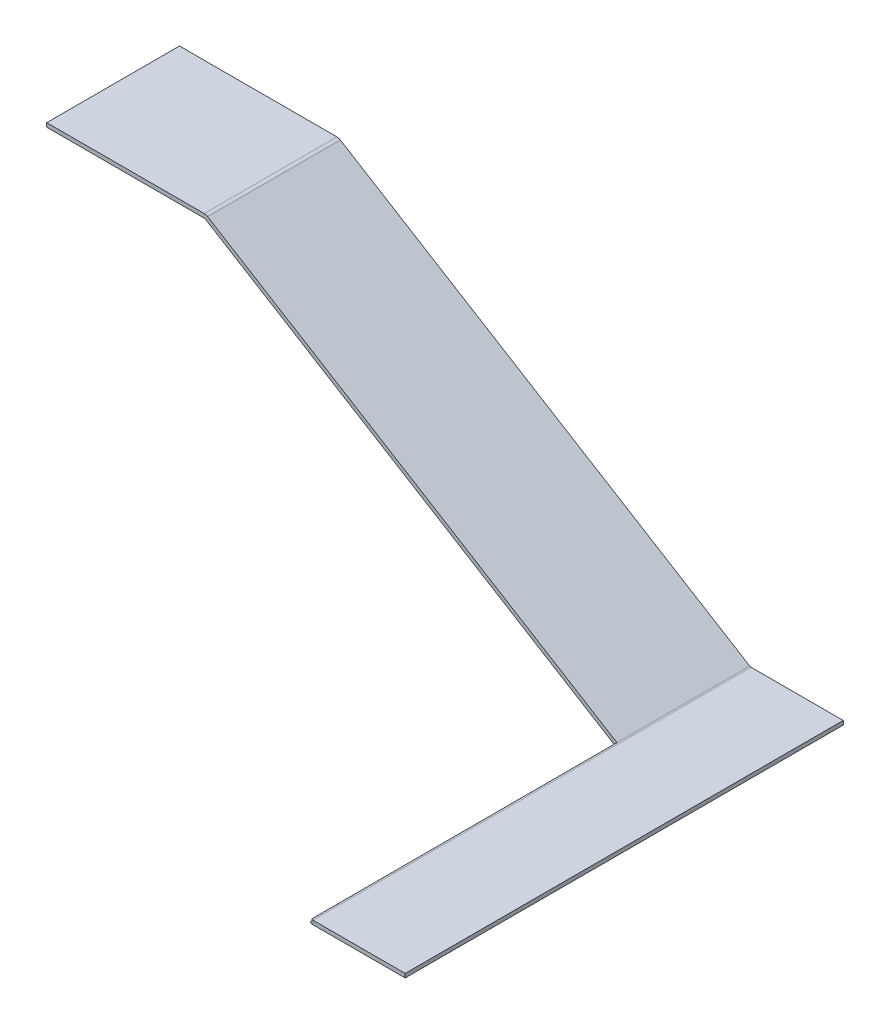
ISO-10303-21;
HEADER;
FILE_DESCRIPTION(('STEP AP214'),'2;1');
FILE_NAME('part.step','',(''),(''),'','','');
FILE_SCHEMA(('AUTOMOTIVE_DESIGN { 1 0 10303 214 1 1 1 1 }'));
ENDSEC;
DATA;
#1=APPLICATION_CONTEXT('core data for automotive mechanical design processes');
#2=APPLICATION_PROTOCOL_DEFINITION('international standard','automotive_design',2000,#1);
#3=PRODUCT_CONTEXT('',#1,'mechanical');
#4=PRODUCT('Part','Part','',(#3));
#5=PRODUCT_RELATED_PRODUCT_CATEGORY('part','',(#4));
#6=PRODUCT_DEFINITION_FORMATION('','',#4);
#7=PRODUCT_DEFINITION_CONTEXT('part definition',#1,'design');
#8=PRODUCT_DEFINITION('design','',#6,#7);
#9=PRODUCT_DEFINITION_SHAPE('','',#8);
#10=(LENGTH_UNIT() NAMED_UNIT(*) SI_UNIT(.MILLI.,.METRE.));
#11=(NAMED_UNIT(*) PLANE_ANGLE_UNIT() SI_UNIT($,.RADIAN.));
#12=(NAMED_UNIT(*) SI_UNIT($,.STERADIAN.) SOLID_ANGLE_UNIT());
#13=UNCERTAINTY_MEASURE_WITH_UNIT(LENGTH_MEASURE(1.E-05),#10,'distance_accuracy_value','');
#14=(GEOMETRIC_REPRESENTATION_CONTEXT(3) GLOBAL_UNCERTAINTY_ASSIGNED_CONTEXT((#13)) GLOBAL_UNIT_ASSIGNED_CONTEXT((#10,
#11,#12)) REPRESENTATION_CONTEXT('',''));
#15=CARTESIAN_POINT('',(0.,0.,0.));
#16=DIRECTION('',(0.,0.,1.));
#17=DIRECTION('',(1.,0.,0.));
#18=AXIS2_PLACEMENT_3D('',#15,#16,#17);
#19=CARTESIAN_POINT('',(59.2948265887637,0.,0.));
#20=DIRECTION('',(0.,0.,-1.));
#21=DIRECTION('',(-1.,0.,0.));
#22=AXIS2_PLACEMENT_3D('',#19,#20,#21);
#23=PLANE('',#22);
#24=DIRECTION('',(0.,-1.,0.));
#25=VECTOR('',#24,1.);
#26=CARTESIAN_POINT('',(59.2948265887637,0.,0.));
#27=LINE('',#26,#25);
#28=CARTESIAN_POINT('',(59.2948265887637,0.,0.));
#29=VERTEX_POINT('',#28);
#30=CARTESIAN_POINT('',(59.2948265887637,-1.5,0.));
#31=VERTEX_POINT('',#30);
#32=EDGE_CURVE('E267',#29,#31,#27,.T.);
#33=ORIENTED_EDGE('',*,*,#32,.F.);
#34=CARTESIAN_POINT('',(59.2948265887637,-2.5,0.));
#35=DIRECTION('',(0.,0.,1.));
#36=DIRECTION('',(1.,0.,0.));
#37=AXIS2_PLACEMENT_3D('',#34,#35,#36);
#38=CIRCLE('',#37,2.5);
#39=CARTESIAN_POINT('',(60.6012317335869,-0.368496868972642,0.));
#40=VERTEX_POINT('',#39);
#41=EDGE_CURVE('E214',#29,#40,#38,.F.);
#42=ORIENTED_EDGE('',*,*,#41,.T.);
#43=DIRECTION('',(0.522562057929286,0.852601252410943,0.));
#44=VECTOR('',#43,1.);
#45=CARTESIAN_POINT('',(59.817388646693,-1.64739874758906,0.));
#46=LINE('',#45,#44);
#47=CARTESIAN_POINT('',(59.817388646693,-1.64739874758906,0.));
#48=VERTEX_POINT('',#47);
#49=EDGE_CURVE('E264',#48,#40,#46,.T.);
#50=ORIENTED_EDGE('',*,*,#49,.F.);
#51=CARTESIAN_POINT('',(59.2948265887637,-2.5,0.));
#52=DIRECTION('',(0.,0.,1.));
#53=DIRECTION('',(1.,0.,0.));
#54=AXIS2_PLACEMENT_3D('',#51,#52,#53);
#55=CIRCLE('',#54,1.);
#56=EDGE_CURVE('E226',#31,#48,#55,.F.);
#57=ORIENTED_EDGE('',*,*,#56,.F.);
#58=EDGE_LOOP('',(#33,#42,#50,#57));
#59=FACE_BOUND('',#58,.T.);
#60=ADVANCED_FACE('F37',(#59),#23,.T.);
#61=CARTESIAN_POINT('',(59.817388646693,-1.64739874758906,0.));
#62=DIRECTION('',(0.,0.,-1.));
#63=DIRECTION('',(-1.,0.,0.));
#64=AXIS2_PLACEMENT_3D('',#61,#62,#63);
#65=PLANE('',#64);
#66=DIRECTION('',(1.,0.,0.));
#67=VECTOR('',#66,1.);
#68=CARTESIAN_POINT('',(0.,0.,0.));
#69=LINE('',#68,#67);
#70=CARTESIAN_POINT('',(0.,0.,0.));
#71=VERTEX_POINT('',#70);
#72=EDGE_CURVE('E217',#71,#29,#69,.T.);
#73=ORIENTED_EDGE('',*,*,#72,.T.);
#74=ORIENTED_EDGE('',*,*,#32,.T.);
#75=DIRECTION('',(1.,0.,0.));
#76=VECTOR('',#75,1.);
#77=CARTESIAN_POINT('',(0.,-1.5,0.));
#78=LINE('',#77,#76);
#79=CARTESIAN_POINT('',(0.,-1.5,0.));
#80=VERTEX_POINT('',#79);
#81=EDGE_CURVE('E223',#80,#31,#78,.T.);
#82=ORIENTED_EDGE('',*,*,#81,.F.);
#83=DIRECTION('',(0.,1.,0.));
#84=VECTOR('',#83,1.);
#85=CARTESIAN_POINT('',(0.,-1.5,0.));
#86=LINE('',#85,#84);
#87=EDGE_CURVE('E220',#80,#71,#86,.T.);
#88=ORIENTED_EDGE('',*,*,#87,.T.);
#89=EDGE_LOOP('',(#73,#74,#82,#88));
#90=FACE_BOUND('',#89,.T.);
#91=ADVANCED_FACE('F302',(#90),#65,.T.);
#92=CARTESIAN_POINT('',(215.282069364494,-95.,165.));
#93=DIRECTION('',(0.,0.,1.));
#94=DIRECTION('',(1.,0.,0.));
#95=AXIS2_PLACEMENT_3D('',#92,#93,#94);
#96=PLANE('',#95);
#97=DIRECTION('',(0.522562057929288,0.852601252410943,0.));
#98=VECTOR('',#97,1.);
#99=CARTESIAN_POINT('',(215.072665575553,-94.871655742262,165.));
#100=LINE('',#99,#98);
#101=CARTESIAN_POINT('',(214.219838846333,-96.2631098794108,165.));
#102=VERTEX_POINT('',#101);
#103=CARTESIAN_POINT('',(214.995640582677,-94.9973280990602,165.));
#104=VERTEX_POINT('',#103);
#105=EDGE_CURVE('E155',#102,#104,#100,.T.);
#106=ORIENTED_EDGE('',*,*,#105,.F.);
#107=CARTESIAN_POINT('',(215.282069364494,-94.,165.));
#108=DIRECTION('',(0.,0.,1.));
#109=DIRECTION('',(1.,0.,0.));
#110=AXIS2_PLACEMENT_3D('',#107,#108,#109);
#111=CIRCLE('',#110,2.5);
#112=CARTESIAN_POINT('',(215.282069364494,-96.5,165.));
#113=VERTEX_POINT('',#112);
#114=EDGE_CURVE('E60',#102,#113,#111,.T.);
#115=ORIENTED_EDGE('',*,*,#114,.T.);
#116=DIRECTION('',(0.,-1.,0.));
#117=VECTOR('',#116,1.);
#118=CARTESIAN_POINT('',(215.282069364494,-95.,165.));
#119=LINE('',#118,#117);
#120=CARTESIAN_POINT('',(215.282069364494,-95.,165.));
#121=VERTEX_POINT('',#120);
#122=EDGE_CURVE('E262',#121,#113,#119,.T.);
#123=ORIENTED_EDGE('',*,*,#122,.F.);
#124=CARTESIAN_POINT('',(215.282069364494,-94.,165.));
#125=DIRECTION('',(0.,0.,-1.));
#126=DIRECTION('',(-1.,0.,0.));
#127=AXIS2_PLACEMENT_3D('',#124,#125,#126);
#128=CIRCLE('',#127,1.);
#129=CARTESIAN_POINT('',(214.759507306565,-94.8526012524109,165.));
#130=VERTEX_POINT('',#129);
#131=EDGE_CURVE('E196',#130,#121,#128,.F.);
#132=ORIENTED_EDGE('',*,*,#131,.F.);
#133=DIRECTION('',(0.852601252410943,-0.522562057929288,0.));
#134=VECTOR('',#133,1.);
#135=CARTESIAN_POINT('',(215.205044371618,-95.1256723567982,165.));
#136=LINE('',#135,#134);
#137=EDGE_CURVE('E185',#130,#104,#136,.T.);
#138=ORIENTED_EDGE('',*,*,#137,.T.);
#139=EDGE_LOOP('',(#106,#115,#123,#132,#138));
#140=FACE_BOUND('',#139,.T.);
#141=ADVANCED_FACE('F273',(#140),#96,.T.);
#142=CARTESIAN_POINT('',(213.975664219671,-96.1315031310273,165.));
#143=DIRECTION('',(0.,0.,1.));
#144=DIRECTION('',(1.,0.,0.));
#145=AXIS2_PLACEMENT_3D('',#142,#143,#144);
#146=PLANE('',#145);
#147=DIRECTION('',(1.,0.,0.));
#148=VECTOR('',#147,1.);
#149=CARTESIAN_POINT('',(215.,-95.,165.));
#150=LINE('',#149,#148);
#151=CARTESIAN_POINT('',(250.,-95.,165.));
#152=VERTEX_POINT('',#151);
#153=EDGE_CURVE('E193',#121,#152,#150,.T.);
#154=ORIENTED_EDGE('',*,*,#153,.F.);
#155=ORIENTED_EDGE('',*,*,#122,.T.);
#156=DIRECTION('',(1.,0.,0.));
#157=VECTOR('',#156,1.);
#158=CARTESIAN_POINT('',(215.,-96.5,165.));
#159=LINE('',#158,#157);
#160=CARTESIAN_POINT('',(250.,-96.5,165.));
#161=VERTEX_POINT('',#160);
#162=EDGE_CURVE('E112',#113,#161,#159,.T.);
#163=ORIENTED_EDGE('',*,*,#162,.T.);
#164=DIRECTION('',(0.,-1.,0.));
#165=VECTOR('',#164,1.);
#166=CARTESIAN_POINT('',(250.,-95.,165.));
#167=LINE('',#166,#165);
#168=EDGE_CURVE('E189',#152,#161,#167,.T.);
#169=ORIENTED_EDGE('',*,*,#168,.F.);
#170=EDGE_LOOP('',(#154,#155,#163,#169));
#171=FACE_BOUND('',#170,.T.);
#172=ADVANCED_FACE('F333',(#171),#146,.T.);
#173=CARTESIAN_POINT('',(214.759507306565,-94.8526012524109,0.));
#174=DIRECTION('',(0.,0.,-1.));
#175=DIRECTION('',(-1.,0.,0.));
#176=AXIS2_PLACEMENT_3D('',#173,#174,#175);
#177=PLANE('',#176);
#178=DIRECTION('',(-0.522562057929298,-0.852601252410936,0.));
#179=VECTOR('',#178,1.);
#180=CARTESIAN_POINT('',(214.759507306565,-94.8526012524109,0.));
#181=LINE('',#180,#179);
#182=CARTESIAN_POINT('',(214.759507306565,-94.8526012524109,0.));
#183=VERTEX_POINT('',#182);
#184=CARTESIAN_POINT('',(213.975664219671,-96.1315031310273,0.));
#185=VERTEX_POINT('',#184);
#186=EDGE_CURVE('E259',#183,#185,#181,.T.);
#187=ORIENTED_EDGE('',*,*,#186,.F.);
#188=CARTESIAN_POINT('',(215.282069364494,-94.,0.));
#189=DIRECTION('',(0.,0.,-1.));
#190=DIRECTION('',(-1.,0.,0.));
#191=AXIS2_PLACEMENT_3D('',#188,#189,#190);
#192=CIRCLE('',#191,1.);
#193=CARTESIAN_POINT('',(215.282069364494,-95.,0.));
#194=VERTEX_POINT('',#193);
#195=EDGE_CURVE('E209',#183,#194,#192,.F.);
#196=ORIENTED_EDGE('',*,*,#195,.T.);
#197=DIRECTION('',(0.,1.,0.));
#198=VECTOR('',#197,1.);
#199=CARTESIAN_POINT('',(215.282069364494,-96.5,0.));
#200=LINE('',#199,#198);
#201=CARTESIAN_POINT('',(215.282069364494,-96.5,0.));
#202=VERTEX_POINT('',#201);
#203=EDGE_CURVE('E105',#202,#194,#200,.T.);
#204=ORIENTED_EDGE('',*,*,#203,.F.);
#205=CARTESIAN_POINT('',(215.282069364494,-94.,0.));
#206=DIRECTION('',(0.,0.,1.));
#207=DIRECTION('',(1.,0.,0.));
#208=AXIS2_PLACEMENT_3D('',#205,#206,#207);
#209=CIRCLE('',#208,2.5);
#210=EDGE_CURVE('E190',#185,#202,#209,.T.);
#211=ORIENTED_EDGE('',*,*,#210,.F.);
#212=EDGE_LOOP('',(#187,#196,#204,#211));
#213=FACE_BOUND('',#212,.T.);
#214=ADVANCED_FACE('F284',(#213),#177,.T.);
#215=CARTESIAN_POINT('',(215.282069364494,-96.5,0.));
#216=DIRECTION('',(0.,0.,-1.));
#217=DIRECTION('',(-1.,0.,0.));
#218=AXIS2_PLACEMENT_3D('',#215,#216,#217);
#219=PLANE('',#218);
#220=DIRECTION('',(0.852601252410943,-0.522562057929287,0.));
#221=VECTOR('',#220,1.);
#222=CARTESIAN_POINT('',(60.,0.,0.));
#223=LINE('',#222,#221);
#224=EDGE_CURVE('E211',#40,#183,#223,.T.);
#225=ORIENTED_EDGE('',*,*,#224,.T.);
#226=ORIENTED_EDGE('',*,*,#186,.T.);
#227=DIRECTION('',(0.852601252410943,-0.522562057929288,0.));
#228=VECTOR('',#227,1.);
#229=CARTESIAN_POINT('',(59.2161569131061,-1.27890187861641,0.));
#230=LINE('',#229,#228);
#231=EDGE_CURVE('E229',#48,#185,#230,.T.);
#232=ORIENTED_EDGE('',*,*,#231,.F.);
#233=ORIENTED_EDGE('',*,*,#49,.T.);
#234=EDGE_LOOP('',(#225,#226,#232,#233));
#235=FACE_BOUND('',#234,.T.);
#236=ADVANCED_FACE('F287',(#235),#219,.T.);
#237=CARTESIAN_POINT('',(215.,-96.5,165.));
#238=DIRECTION('',(0.,1.,0.));
#239=DIRECTION('',(0.,0.,1.));
#240=AXIS2_PLACEMENT_3D('',#237,#238,#239);
#241=PLANE('',#240);
#242=DIRECTION('',(1.,0.,0.));
#243=VECTOR('',#242,1.);
#244=CARTESIAN_POINT('',(215.,-96.5,0.));
#245=LINE('',#244,#243);
#246=CARTESIAN_POINT('',(250.,-96.5,0.));
#247=VERTEX_POINT('',#246);
#248=EDGE_CURVE('E187',#202,#247,#245,.T.);
#249=ORIENTED_EDGE('',*,*,#248,.T.);
#250=DIRECTION('',(0.,0.,-1.));
#251=VECTOR('',#250,1.);
#252=CARTESIAN_POINT('',(250.,-96.5,165.));
#253=LINE('',#252,#251);
#254=EDGE_CURVE('E256',#161,#247,#253,.T.);
#255=ORIENTED_EDGE('',*,*,#254,.F.);
#256=ORIENTED_EDGE('',*,*,#162,.F.);
#257=DIRECTION('',(0.,0.,-1.));
#258=VECTOR('',#257,1.);
#259=CARTESIAN_POINT('',(215.282069364494,-96.5,165.));
#260=LINE('',#259,#258);
#261=EDGE_CURVE('E200',#113,#202,#260,.T.);
#262=ORIENTED_EDGE('',*,*,#261,.T.);
#263=EDGE_LOOP('',(#249,#255,#256,#262));
#264=FACE_BOUND('',#263,.T.);
#265=ADVANCED_FACE('F342',(#264),#241,.F.);
#266=CARTESIAN_POINT('',(250.,-95.,165.));
#267=DIRECTION('',(1.,0.,0.));
#268=DIRECTION('',(0.,0.,-1.));
#269=AXIS2_PLACEMENT_3D('',#266,#267,#268);
#270=PLANE('',#269);
#271=DIRECTION('',(0.,-1.,0.));
#272=VECTOR('',#271,1.);
#273=CARTESIAN_POINT('',(250.,-95.,0.));
#274=LINE('',#273,#272);
#275=CARTESIAN_POINT('',(250.,-95.,0.));
#276=VERTEX_POINT('',#275);
#277=EDGE_CURVE('E203',#276,#247,#274,.T.);
#278=ORIENTED_EDGE('',*,*,#277,.F.);
#279=DIRECTION('',(0.,0.,-1.));
#280=VECTOR('',#279,1.);
#281=CARTESIAN_POINT('',(250.,-95.,165.));
#282=LINE('',#281,#280);
#283=EDGE_CURVE('E254',#152,#276,#282,.T.);
#284=ORIENTED_EDGE('',*,*,#283,.F.);
#285=ORIENTED_EDGE('',*,*,#168,.T.);
#286=ORIENTED_EDGE('',*,*,#254,.T.);
#287=EDGE_LOOP('',(#278,#284,#285,#286));
#288=FACE_BOUND('',#287,.T.);
#289=ADVANCED_FACE('F345',(#288),#270,.T.);
#290=CARTESIAN_POINT('',(215.,-95.,165.));
#291=DIRECTION('',(0.,1.,0.));
#292=DIRECTION('',(0.,0.,1.));
#293=AXIS2_PLACEMENT_3D('',#290,#291,#292);
#294=PLANE('',#293);
#295=DIRECTION('',(1.,0.,0.));
#296=VECTOR('',#295,1.);
#297=CARTESIAN_POINT('',(215.,-95.,0.));
#298=LINE('',#297,#296);
#299=EDGE_CURVE('E206',#194,#276,#298,.T.);
#300=ORIENTED_EDGE('',*,*,#299,.F.);
#301=DIRECTION('',(0.,0.,-1.));
#302=VECTOR('',#301,1.);
#303=CARTESIAN_POINT('',(215.282069364494,-95.,165.));
#304=LINE('',#303,#302);
#305=EDGE_CURVE('E251',#121,#194,#304,.T.);
#306=ORIENTED_EDGE('',*,*,#305,.F.);
#307=ORIENTED_EDGE('',*,*,#153,.T.);
#308=ORIENTED_EDGE('',*,*,#283,.T.);
#309=EDGE_LOOP('',(#300,#306,#307,#308));
#310=FACE_BOUND('',#309,.T.);
#311=ADVANCED_FACE('F349',(#310),#294,.T.);
#312=CARTESIAN_POINT('',(215.282069364494,-94.,165.));
#313=DIRECTION('',(0.,0.,-1.));
#314=DIRECTION('',(-1.,0.,0.));
#315=AXIS2_PLACEMENT_3D('',#312,#313,#314);
#316=CYLINDRICAL_SURFACE('',#315,1.);
#317=ORIENTED_EDGE('',*,*,#195,.F.);
#318=DIRECTION('',(0.,0.,-1.));
#319=VECTOR('',#318,1.);
#320=CARTESIAN_POINT('',(214.759507306565,-94.8526012524109,165.));
#321=LINE('',#320,#319);
#322=CARTESIAN_POINT('',(214.759507306565,-94.8526012524109,50.));
#323=VERTEX_POINT('',#322);
#324=EDGE_CURVE('E249',#323,#183,#321,.T.);
#325=ORIENTED_EDGE('',*,*,#324,.F.);
#326=EDGE_CURVE('E166',#130,#323,#321,.T.);
#327=ORIENTED_EDGE('',*,*,#326,.F.);
#328=ORIENTED_EDGE('',*,*,#131,.T.);
#329=ORIENTED_EDGE('',*,*,#305,.T.);
#330=EDGE_LOOP('',(#317,#325,#327,#328,#329));
#331=FACE_BOUND('',#330,.T.);
#332=ADVANCED_FACE('F278',(#331),#316,.F.);
#333=CARTESIAN_POINT('',(60.,0.,165.));
#334=DIRECTION('',(0.522562057929288,0.852601252410943,0.));
#335=DIRECTION('',(-0.852601252410943,0.522562057929288,0.));
#336=AXIS2_PLACEMENT_3D('',#333,#334,#335);
#337=PLANE('',#336);
#338=DIRECTION('',(-0.852601252410943,0.522562057929288,0.));
#339=VECTOR('',#338,1.);
#340=CARTESIAN_POINT('',(-11.5017052792805,43.8236258163332,50.));
#341=LINE('',#340,#339);
#342=CARTESIAN_POINT('',(60.6012317335869,-0.36849686897264,50.));
#343=VERTEX_POINT('',#342);
#344=EDGE_CURVE('E162',#323,#343,#341,.T.);
#345=ORIENTED_EDGE('',*,*,#344,.F.);
#346=ORIENTED_EDGE('',*,*,#324,.T.);
#347=ORIENTED_EDGE('',*,*,#224,.F.);
#348=DIRECTION('',(0.,0.,-1.));
#349=VECTOR('',#348,1.);
#350=CARTESIAN_POINT('',(60.6012317335869,-0.368496868972642,165.));
#351=LINE('',#350,#349);
#352=EDGE_CURVE('E247',#343,#40,#351,.T.);
#353=ORIENTED_EDGE('',*,*,#352,.F.);
#354=EDGE_LOOP('',(#345,#346,#347,#353));
#355=FACE_BOUND('',#354,.T.);
#356=ADVANCED_FACE('F282',(#355),#337,.T.);
#357=CARTESIAN_POINT('',(59.2948265887637,-2.5,165.));
#358=DIRECTION('',(0.,0.,-1.));
#359=DIRECTION('',(-1.,0.,0.));
#360=AXIS2_PLACEMENT_3D('',#357,#358,#359);
#361=CYLINDRICAL_SURFACE('',#360,2.5);
#362=CARTESIAN_POINT('',(59.2948265887637,-2.5,50.));
#363=DIRECTION('',(0.,0.,-1.));
#364=DIRECTION('',(-1.,0.,0.));
#365=AXIS2_PLACEMENT_3D('',#362,#363,#364);
#366=CIRCLE('',#365,2.5);
#367=CARTESIAN_POINT('',(59.2948265887637,0.,50.));
#368=VERTEX_POINT('',#367);
#369=EDGE_CURVE('E183',#343,#368,#366,.F.);
#370=ORIENTED_EDGE('',*,*,#369,.F.);
#371=ORIENTED_EDGE('',*,*,#352,.T.);
#372=ORIENTED_EDGE('',*,*,#41,.F.);
#373=DIRECTION('',(0.,0.,-1.));
#374=VECTOR('',#373,1.);
#375=CARTESIAN_POINT('',(59.2948265887637,0.,165.));
#376=LINE('',#375,#374);
#377=EDGE_CURVE('E245',#368,#29,#376,.T.);
#378=ORIENTED_EDGE('',*,*,#377,.F.);
#379=EDGE_LOOP('',(#370,#371,#372,#378));
#380=FACE_BOUND('',#379,.T.);
#381=ADVANCED_FACE('F317',(#380),#361,.T.);
#382=CARTESIAN_POINT('',(0.,0.,165.));
#383=DIRECTION('',(0.,1.,0.));
#384=DIRECTION('',(0.,0.,1.));
#385=AXIS2_PLACEMENT_3D('',#382,#383,#384);
#386=PLANE('',#385);
#387=DIRECTION('',(-1.,0.,0.));
#388=VECTOR('',#387,1.);
#389=CARTESIAN_POINT('',(0.,0.,50.));
#390=LINE('',#389,#388);
#391=CARTESIAN_POINT('',(0.,0.,50.));
#392=VERTEX_POINT('',#391);
#393=EDGE_CURVE('E181',#368,#392,#390,.T.);
#394=ORIENTED_EDGE('',*,*,#393,.F.);
#395=ORIENTED_EDGE('',*,*,#377,.T.);
#396=ORIENTED_EDGE('',*,*,#72,.F.);
#397=DIRECTION('',(0.,0.,-1.));
#398=VECTOR('',#397,1.);
#399=CARTESIAN_POINT('',(0.,0.,165.));
#400=LINE('',#399,#398);
#401=EDGE_CURVE('E243',#392,#71,#400,.T.);
#402=ORIENTED_EDGE('',*,*,#401,.F.);
#403=EDGE_LOOP('',(#394,#395,#396,#402));
#404=FACE_BOUND('',#403,.T.);
#405=ADVANCED_FACE('F313',(#404),#386,.T.);
#406=CARTESIAN_POINT('',(0.,-1.5,165.));
#407=DIRECTION('',(-1.,0.,0.));
#408=DIRECTION('',(0.,0.,1.));
#409=AXIS2_PLACEMENT_3D('',#406,#407,#408);
#410=PLANE('',#409);
#411=DIRECTION('',(0.,-1.,0.));
#412=VECTOR('',#411,1.);
#413=CARTESIAN_POINT('',(0.,-1.5,50.));
#414=LINE('',#413,#412);
#415=CARTESIAN_POINT('',(0.,-1.5,50.));
#416=VERTEX_POINT('',#415);
#417=EDGE_CURVE('E179',#392,#416,#414,.T.);
#418=ORIENTED_EDGE('',*,*,#417,.F.);
#419=ORIENTED_EDGE('',*,*,#401,.T.);
#420=ORIENTED_EDGE('',*,*,#87,.F.);
#421=DIRECTION('',(0.,0.,-1.));
#422=VECTOR('',#421,1.);
#423=CARTESIAN_POINT('',(0.,-1.5,165.));
#424=LINE('',#423,#422);
#425=EDGE_CURVE('E241',#416,#80,#424,.T.);
#426=ORIENTED_EDGE('',*,*,#425,.F.);
#427=EDGE_LOOP('',(#418,#419,#420,#426));
#428=FACE_BOUND('',#427,.T.);
#429=ADVANCED_FACE('F309',(#428),#410,.T.);
#430=CARTESIAN_POINT('',(0.,-1.5,165.));
#431=DIRECTION('',(0.,1.,0.));
#432=DIRECTION('',(0.,0.,1.));
#433=AXIS2_PLACEMENT_3D('',#430,#431,#432);
#434=PLANE('',#433);
#435=DIRECTION('',(0.,0.,-1.));
#436=VECTOR('',#435,1.);
#437=CARTESIAN_POINT('',(59.2948265887637,-1.5,165.));
#438=LINE('',#437,#436);
#439=CARTESIAN_POINT('',(59.2948265887637,-1.5,50.));
#440=VERTEX_POINT('',#439);
#441=EDGE_CURVE('E239',#440,#31,#438,.T.);
#442=ORIENTED_EDGE('',*,*,#441,.F.);
#443=DIRECTION('',(-1.,0.,0.));
#444=VECTOR('',#443,1.);
#445=CARTESIAN_POINT('',(0.,-1.5,50.));
#446=LINE('',#445,#444);
#447=EDGE_CURVE('E176',#440,#416,#446,.T.);
#448=ORIENTED_EDGE('',*,*,#447,.T.);
#449=ORIENTED_EDGE('',*,*,#425,.T.);
#450=ORIENTED_EDGE('',*,*,#81,.T.);
#451=EDGE_LOOP('',(#442,#448,#449,#450));
#452=FACE_BOUND('',#451,.T.);
#453=ADVANCED_FACE('F305',(#452),#434,.F.);
#454=CARTESIAN_POINT('',(59.2948265887637,-2.5,165.));
#455=DIRECTION('',(0.,0.,-1.));
#456=DIRECTION('',(-1.,0.,0.));
#457=AXIS2_PLACEMENT_3D('',#454,#455,#456);
#458=CYLINDRICAL_SURFACE('',#457,1.);
#459=DIRECTION('',(0.,0.,-1.));
#460=VECTOR('',#459,1.);
#461=CARTESIAN_POINT('',(59.817388646693,-1.64739874758906,165.));
#462=LINE('',#461,#460);
#463=CARTESIAN_POINT('',(59.817388646693,-1.64739874758905,50.));
#464=VERTEX_POINT('',#463);
#465=EDGE_CURVE('E237',#464,#48,#462,.T.);
#466=ORIENTED_EDGE('',*,*,#465,.F.);
#467=CARTESIAN_POINT('',(59.2948265887637,-2.5,50.));
#468=DIRECTION('',(0.,0.,-1.));
#469=DIRECTION('',(-1.,0.,0.));
#470=AXIS2_PLACEMENT_3D('',#467,#468,#469);
#471=CIRCLE('',#470,1.);
#472=EDGE_CURVE('E173',#464,#440,#471,.F.);
#473=ORIENTED_EDGE('',*,*,#472,.T.);
#474=ORIENTED_EDGE('',*,*,#441,.T.);
#475=ORIENTED_EDGE('',*,*,#56,.T.);
#476=EDGE_LOOP('',(#466,#473,#474,#475));
#477=FACE_BOUND('',#476,.T.);
#478=ADVANCED_FACE('F297',(#477),#458,.F.);
#479=CARTESIAN_POINT('',(59.2161569131061,-1.27890187861641,165.));
#480=DIRECTION('',(0.522562057929287,0.852601252410943,0.));
#481=DIRECTION('',(-0.852601252410943,0.522562057929287,0.));
#482=AXIS2_PLACEMENT_3D('',#479,#480,#481);
#483=PLANE('',#482);
#484=DIRECTION('',(0.,0.,-1.));
#485=VECTOR('',#484,1.);
#486=CARTESIAN_POINT('',(213.975664219671,-96.1315031310273,165.));
#487=LINE('',#486,#485);
#488=CARTESIAN_POINT('',(213.975664219671,-96.1315031310273,50.));
#489=VERTEX_POINT('',#488);
#490=EDGE_CURVE('E235',#489,#185,#487,.T.);
#491=ORIENTED_EDGE('',*,*,#490,.F.);
#492=DIRECTION('',(-0.852601252410943,0.522562057929287,0.));
#493=VECTOR('',#492,1.);
#494=CARTESIAN_POINT('',(59.2161569131061,-1.27890187861641,50.));
#495=LINE('',#494,#493);
#496=EDGE_CURVE('E170',#489,#464,#495,.T.);
#497=ORIENTED_EDGE('',*,*,#496,.T.);
#498=ORIENTED_EDGE('',*,*,#465,.T.);
#499=ORIENTED_EDGE('',*,*,#231,.T.);
#500=EDGE_LOOP('',(#491,#497,#498,#499));
#501=FACE_BOUND('',#500,.T.);
#502=ADVANCED_FACE('F289',(#501),#483,.F.);
#503=CARTESIAN_POINT('',(215.282069364494,-94.,165.));
#504=DIRECTION('',(0.,0.,-1.));
#505=DIRECTION('',(-1.,0.,0.));
#506=AXIS2_PLACEMENT_3D('',#503,#504,#505);
#507=CYLINDRICAL_SURFACE('',#506,2.5);
#508=DIRECTION('',(0.,0.,-1.));
#509=VECTOR('',#508,1.);
#510=CARTESIAN_POINT('',(214.219838846333,-96.2631098794108,165.));
#511=LINE('',#510,#509);
#512=CARTESIAN_POINT('',(214.219838846333,-96.2631098794108,50.));
#513=VERTEX_POINT('',#512);
#514=EDGE_CURVE('E44',#102,#513,#511,.T.);
#515=ORIENTED_EDGE('',*,*,#514,.T.);
#516=CARTESIAN_POINT('',(215.282069364494,-94.,50.));
#517=DIRECTION('',(0.,0.,-1.));
#518=DIRECTION('',(-1.,0.,0.));
#519=AXIS2_PLACEMENT_3D('',#516,#517,#518);
#520=CIRCLE('',#519,2.5);
#521=EDGE_CURVE('E11',#513,#489,#520,.T.);
#522=ORIENTED_EDGE('',*,*,#521,.T.);
#523=ORIENTED_EDGE('',*,*,#490,.T.);
#524=ORIENTED_EDGE('',*,*,#210,.T.);
#525=ORIENTED_EDGE('',*,*,#261,.F.);
#526=ORIENTED_EDGE('',*,*,#114,.F.);
#527=EDGE_LOOP('',(#515,#522,#523,#524,#525,#526));
#528=FACE_BOUND('',#527,.T.);
#529=ADVANCED_FACE('F270',(#528),#507,.T.);
#530=CARTESIAN_POINT('',(215.282069364494,-94.,0.));
#531=DIRECTION('',(0.,0.,-1.));
#532=DIRECTION('',(-1.,0.,0.));
#533=AXIS2_PLACEMENT_3D('',#530,#531,#532);
#534=PLANE('',#533);
#535=ORIENTED_EDGE('',*,*,#248,.F.);
#536=ORIENTED_EDGE('',*,*,#203,.T.);
#537=ORIENTED_EDGE('',*,*,#299,.T.);
#538=ORIENTED_EDGE('',*,*,#277,.T.);
#539=EDGE_LOOP('',(#535,#536,#537,#538));
#540=FACE_BOUND('',#539,.T.);
#541=ADVANCED_FACE('F422',(#540),#534,.T.);
#542=CARTESIAN_POINT('',(16.3842662632375,26.732223903177,0.));
#543=DIRECTION('',(-0.522562057929288,-0.852601252410943,0.));
#544=DIRECTION('',(0.852601252410943,-0.522562057929288,0.));
#545=AXIS2_PLACEMENT_3D('',#542,#543,#544);
#546=PLANE('',#545);
#547=ORIENTED_EDGE('',*,*,#326,.T.);
#548=CARTESIAN_POINT('',(214.995640582677,-94.9973280990602,50.));
#549=VERTEX_POINT('',#548);
#550=EDGE_CURVE('E152',#549,#323,#341,.T.);
#551=ORIENTED_EDGE('',*,*,#550,.F.);
#552=DIRECTION('',(0.,0.,-1.));
#553=VECTOR('',#552,1.);
#554=CARTESIAN_POINT('',(214.995640582677,-94.9973280990602,50.));
#555=LINE('',#554,#553);
#556=EDGE_CURVE('E158',#104,#549,#555,.T.);
#557=ORIENTED_EDGE('',*,*,#556,.F.);
#558=ORIENTED_EDGE('',*,*,#137,.F.);
#559=EDGE_LOOP('',(#547,#551,#557,#558));
#560=FACE_BOUND('',#559,.T.);
#561=ADVANCED_FACE('F164',(#560),#546,.T.);
#562=CARTESIAN_POINT('',(-70.8802983201277,-53.0572365134701,50.));
#563=DIRECTION('',(0.,0.,-1.));
#564=DIRECTION('',(-1.,0.,0.));
#565=AXIS2_PLACEMENT_3D('',#562,#563,#564);
#566=PLANE('',#565);
#567=ORIENTED_EDGE('',*,*,#369,.T.);
#568=ORIENTED_EDGE('',*,*,#393,.T.);
#569=ORIENTED_EDGE('',*,*,#417,.T.);
#570=ORIENTED_EDGE('',*,*,#447,.F.);
#571=ORIENTED_EDGE('',*,*,#472,.F.);
#572=ORIENTED_EDGE('',*,*,#496,.F.);
#573=ORIENTED_EDGE('',*,*,#521,.F.);
#574=DIRECTION('',(0.522562057929288,0.852601252410943,0.));
#575=VECTOR('',#574,1.);
#576=CARTESIAN_POINT('',(155.61704754183,-191.878190428863,50.));
#577=LINE('',#576,#575);
#578=EDGE_CURVE('E51',#513,#549,#577,.T.);
#579=ORIENTED_EDGE('',*,*,#578,.T.);
#580=ORIENTED_EDGE('',*,*,#550,.T.);
#581=ORIENTED_EDGE('',*,*,#344,.T.);
#582=EDGE_LOOP('',(#567,#568,#569,#570,#571,#572,#573,#579,#580,#581));
#583=FACE_BOUND('',#582,.T.);
#584=ADVANCED_FACE('F150',(#583),#566,.F.);
#585=CARTESIAN_POINT('',(155.61704754183,-191.878190428863,50.));
#586=DIRECTION('',(0.852601252410943,-0.522562057929288,0.));
#587=DIRECTION('',(0.522562057929288,0.852601252410943,0.));
#588=AXIS2_PLACEMENT_3D('',#585,#586,#587);
#589=PLANE('',#588);
#590=ORIENTED_EDGE('',*,*,#105,.T.);
#591=ORIENTED_EDGE('',*,*,#556,.T.);
#592=ORIENTED_EDGE('',*,*,#578,.F.);
#593=ORIENTED_EDGE('',*,*,#514,.F.);
#594=EDGE_LOOP('',(#590,#591,#592,#593));
#595=FACE_BOUND('',#594,.T.);
#596=ADVANCED_FACE('F159',(#595),#589,.F.);
#597=CLOSED_SHELL('',(#60,#91,#141,#172,#214,#236,#265,#289,#311,#332,#356,#381,#405,#429,#453,
#478,#502,#529,#541,#561,#584,#596));
#598=MANIFOLD_SOLID_BREP('B2',#597);
#599=ADVANCED_BREP_SHAPE_REPRESENTATION('',(#18,#598),#14);
#600=SHAPE_DEFINITION_REPRESENTATION(#9,#599);
ENDSEC;
END-ISO-10303-21;
